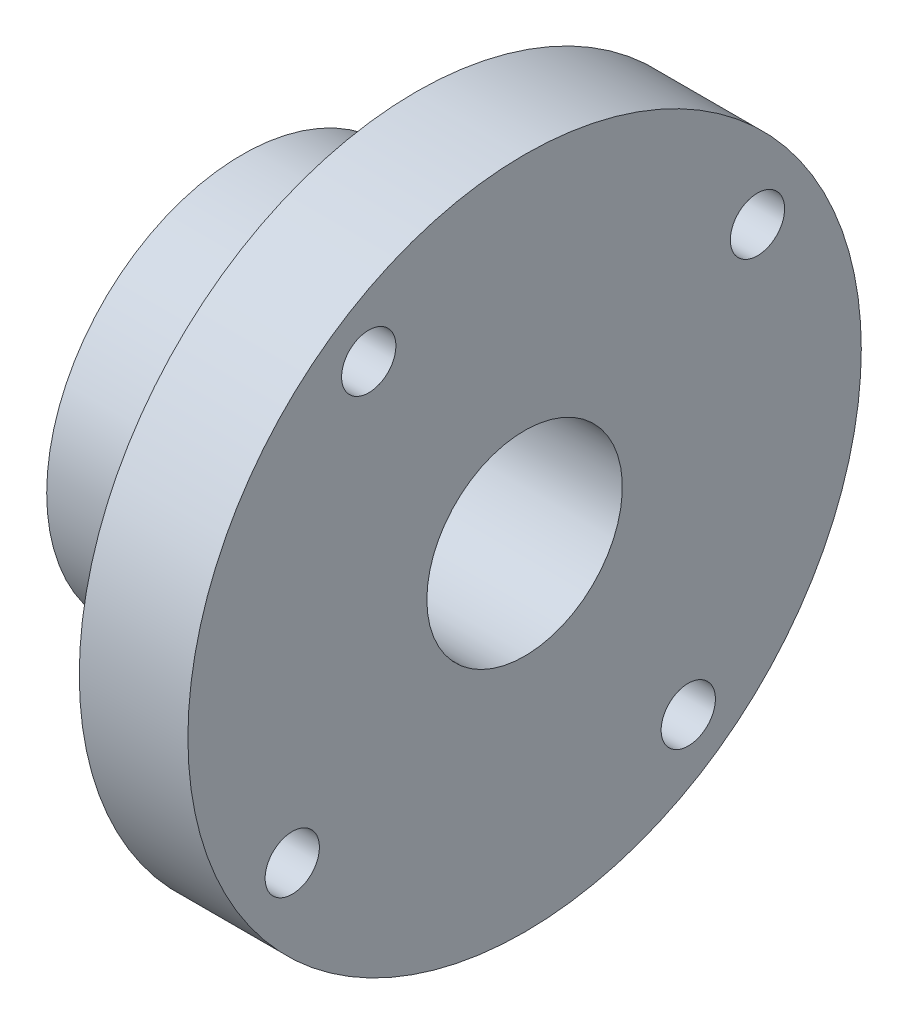
ISO-10303-21;
HEADER;
FILE_DESCRIPTION(('STEP AP214'),'2;1');
FILE_NAME('part.step','',(''),(''),'','','');
FILE_SCHEMA(('AUTOMOTIVE_DESIGN { 1 0 10303 214 1 1 1 1 }'));
ENDSEC;
DATA;
#1=APPLICATION_CONTEXT('core data for automotive mechanical design processes');
#2=APPLICATION_PROTOCOL_DEFINITION('international standard','automotive_design',2000,#1);
#3=PRODUCT_CONTEXT('',#1,'mechanical');
#4=PRODUCT('Part','Part','',(#3));
#5=PRODUCT_RELATED_PRODUCT_CATEGORY('part','',(#4));
#6=PRODUCT_DEFINITION_FORMATION('','',#4);
#7=PRODUCT_DEFINITION_CONTEXT('part definition',#1,'design');
#8=PRODUCT_DEFINITION('design','',#6,#7);
#9=PRODUCT_DEFINITION_SHAPE('','',#8);
#10=(LENGTH_UNIT() NAMED_UNIT(*) SI_UNIT(.MILLI.,.METRE.));
#11=(NAMED_UNIT(*) PLANE_ANGLE_UNIT() SI_UNIT($,.RADIAN.));
#12=(NAMED_UNIT(*) SI_UNIT($,.STERADIAN.) SOLID_ANGLE_UNIT());
#13=UNCERTAINTY_MEASURE_WITH_UNIT(LENGTH_MEASURE(1.E-05),#10,'distance_accuracy_value','');
#14=(GEOMETRIC_REPRESENTATION_CONTEXT(3) GLOBAL_UNCERTAINTY_ASSIGNED_CONTEXT((#13)) GLOBAL_UNIT_ASSIGNED_CONTEXT((#10,
#11,#12)) REPRESENTATION_CONTEXT('',''));
#15=CARTESIAN_POINT('',(0.,0.,0.));
#16=DIRECTION('',(0.,0.,1.));
#17=DIRECTION('',(1.,0.,0.));
#18=AXIS2_PLACEMENT_3D('',#15,#16,#17);
#19=CARTESIAN_POINT('',(0.,0.,0.));
#20=DIRECTION('',(1.,0.,0.));
#21=DIRECTION('',(0.,0.,-1.));
#22=AXIS2_PLACEMENT_3D('',#19,#20,#21);
#23=PLANE('',#22);
#24=CARTESIAN_POINT('',(0.,0.,0.));
#25=DIRECTION('',(-1.,0.,0.));
#26=DIRECTION('',(0.,0.,1.));
#27=AXIS2_PLACEMENT_3D('',#24,#25,#26);
#28=CIRCLE('',#27,4.49999999999999);
#29=CARTESIAN_POINT('',(0.,0.,4.49999999999999));
#30=VERTEX_POINT('',#29);
#31=EDGE_CURVE('E60',#30,#30,#28,.T.);
#32=ORIENTED_EDGE('',*,*,#31,.F.);
#33=EDGE_LOOP('',(#32));
#34=FACE_BOUND('',#33,.T.);
#35=CARTESIAN_POINT('',(0.,0.,0.));
#36=DIRECTION('',(-1.,0.,0.));
#37=DIRECTION('',(0.,0.,1.));
#38=AXIS2_PLACEMENT_3D('',#35,#36,#37);
#39=CIRCLE('',#38,7.);
#40=CARTESIAN_POINT('',(0.,0.,7.));
#41=VERTEX_POINT('',#40);
#42=EDGE_CURVE('E10',#41,#41,#39,.T.);
#43=ORIENTED_EDGE('',*,*,#42,.T.);
#44=EDGE_LOOP('',(#43));
#45=FACE_BOUND('',#44,.T.);
#46=ADVANCED_FACE('F32',(#34,#45),#23,.F.);
#47=CARTESIAN_POINT('',(0.,0.,0.));
#48=DIRECTION('',(-1.,0.,0.));
#49=DIRECTION('',(0.,0.,1.));
#50=AXIS2_PLACEMENT_3D('',#47,#48,#49);
#51=CYLINDRICAL_SURFACE('',#50,7.);
#52=ORIENTED_EDGE('',*,*,#42,.F.);
#53=EDGE_LOOP('',(#52));
#54=FACE_BOUND('',#53,.T.);
#55=CARTESIAN_POINT('',(0.8,0.,0.));
#56=DIRECTION('',(-1.,0.,0.));
#57=DIRECTION('',(0.,0.,1.));
#58=AXIS2_PLACEMENT_3D('',#55,#56,#57);
#59=CIRCLE('',#58,7.);
#60=CARTESIAN_POINT('',(0.8,0.,7.));
#61=VERTEX_POINT('',#60);
#62=EDGE_CURVE('E38',#61,#61,#59,.T.);
#63=ORIENTED_EDGE('',*,*,#62,.T.);
#64=EDGE_LOOP('',(#63));
#65=FACE_BOUND('',#64,.T.);
#66=ADVANCED_FACE('F111',(#54,#65),#51,.T.);
#67=CARTESIAN_POINT('',(0.8,7.,0.));
#68=DIRECTION('',(1.,0.,0.));
#69=DIRECTION('',(0.,0.,-1.));
#70=AXIS2_PLACEMENT_3D('',#67,#68,#69);
#71=PLANE('',#70);
#72=ORIENTED_EDGE('',*,*,#62,.F.);
#73=EDGE_LOOP('',(#72));
#74=FACE_BOUND('',#73,.T.);
#75=CARTESIAN_POINT('',(0.8,0.,0.));
#76=DIRECTION('',(-1.,0.,0.));
#77=DIRECTION('',(0.,0.,1.));
#78=AXIS2_PLACEMENT_3D('',#75,#76,#77);
#79=CIRCLE('',#78,9.);
#80=CARTESIAN_POINT('',(0.8,0.,9.));
#81=VERTEX_POINT('',#80);
#82=EDGE_CURVE('E42',#81,#81,#79,.T.);
#83=ORIENTED_EDGE('',*,*,#82,.T.);
#84=EDGE_LOOP('',(#83));
#85=FACE_BOUND('',#84,.T.);
#86=ADVANCED_FACE('F106',(#74,#85),#71,.F.);
#87=CARTESIAN_POINT('',(0.,0.,0.));
#88=DIRECTION('',(-1.,0.,0.));
#89=DIRECTION('',(0.,0.,1.));
#90=AXIS2_PLACEMENT_3D('',#87,#88,#89);
#91=CYLINDRICAL_SURFACE('',#90,9.);
#92=CARTESIAN_POINT('',(4.56642652347707,1.69370478848819,-8.83919476476518));
#93=CARTESIAN_POINT('',(4.47458480667076,1.69370123663776,-8.83919653942722));
#94=CARTESIAN_POINT('',(4.38269645061478,1.68601792819903,-8.8406783500862));
#95=CARTESIAN_POINT('',(4.20150808720222,1.65550627420318,-8.84644170912226));
#96=CARTESIAN_POINT('',(4.11221038507558,1.63266484740401,-8.85072567567445));
#97=CARTESIAN_POINT('',(3.93885129779513,1.57255797325403,-8.86160185859869));
#98=CARTESIAN_POINT('',(3.85478522090824,1.53530567247893,-8.86819197062734));
#99=CARTESIAN_POINT('',(3.69410755731031,1.44746626537444,-8.88295085369341));
#100=CARTESIAN_POINT('',(3.61749533628368,1.39688029508811,-8.89111949022301));
#101=CARTESIAN_POINT('',(3.47298177684864,1.28316432104925,-8.90824457234338));
#102=CARTESIAN_POINT('',(3.40518204505076,1.21990629891186,-8.91720849026524));
#103=CARTESIAN_POINT('',(3.28110275233958,1.08291474038756,-8.93487865001724));
#104=CARTESIAN_POINT('',(3.22482393190853,1.00918053118149,-8.94358487525397));
#105=CARTESIAN_POINT('',(3.12499628405075,0.852660978970428,-8.95986580821175));
#106=CARTESIAN_POINT('',(3.08154300511002,0.769813715425241,-8.9674318271497));
#107=CARTESIAN_POINT('',(3.00921520394921,0.597832323313218,-8.98053586604881));
#108=CARTESIAN_POINT('',(2.98033953584339,0.508698689519896,-8.98607404540065));
#109=CARTESIAN_POINT('',(2.93830012723746,0.327724674974344,-8.99448203776021));
#110=CARTESIAN_POINT('',(2.92496520770285,0.235925425283924,-8.99738084375545));
#111=CARTESIAN_POINT('',(2.91385268177002,0.0513483211881513,-9.00032661567337));
#112=CARTESIAN_POINT('',(2.91607380642194,-0.0414294527797896,-9.00037381420659));
#113=CARTESIAN_POINT('',(2.93587857420601,-0.224156525851392,-8.99766677871003));
#114=CARTESIAN_POINT('',(2.95327792049152,-0.314126392029767,-8.9949460872789));
#115=CARTESIAN_POINT('',(3.00265401487766,-0.489859602190279,-8.98708957397054));
#116=CARTESIAN_POINT('',(3.03463127678611,-0.575622797787647,-8.98195366696731));
#117=CARTESIAN_POINT('',(3.11243265609037,-0.741043520151741,-8.96982591300897));
#118=CARTESIAN_POINT('',(3.15833091796396,-0.820665417113695,-8.96282415321348));
#119=CARTESIAN_POINT('',(3.2626168500593,-0.971151758409421,-8.94777023149572));
#120=CARTESIAN_POINT('',(3.32100573657394,-1.04201534882923,-8.93971796730886));
#121=CARTESIAN_POINT('',(3.44963245299541,-1.17406213473022,-8.92334452983281));
#122=CARTESIAN_POINT('',(3.52003149048864,-1.23508812705074,-8.91502114472926));
#123=CARTESIAN_POINT('',(3.67014185014585,-1.34448631140504,-8.89918093456902));
#124=CARTESIAN_POINT('',(3.74985329698041,-1.39285833400478,-8.89166412031295));
#125=CARTESIAN_POINT('',(3.91652871866822,-1.47561411523553,-8.87830678117956));
#126=CARTESIAN_POINT('',(4.00350386215949,-1.50997583617216,-8.87246890142195));
#127=CARTESIAN_POINT('',(4.18212258267022,-1.56354346248132,-8.86318668664431));
#128=CARTESIAN_POINT('',(4.27376565458228,-1.58275100396472,-8.85974209323952));
#129=CARTESIAN_POINT('',(4.45770347155008,-1.60523547639814,-8.85569586860607));
#130=CARTESIAN_POINT('',(4.5499697691321,-1.60873810674483,-8.85505396276904));
#131=CARTESIAN_POINT('',(4.73376855974932,-1.60031732420666,-8.85657959446424));
#132=CARTESIAN_POINT('',(4.82530108718983,-1.58839463889761,-8.85874699948791));
#133=CARTESIAN_POINT('',(5.00429798209743,-1.54965609459651,-8.86560454609511));
#134=CARTESIAN_POINT('',(5.09178863503208,-1.52295782942895,-8.87027475950189));
#135=CARTESIAN_POINT('',(5.26105855430728,-1.45555243985945,-8.88158363857301));
#136=CARTESIAN_POINT('',(5.34283741542952,-1.41484432275213,-8.88822244372256));
#137=CARTESIAN_POINT('',(5.49935790132167,-1.32005542223993,-8.90279561241024));
#138=CARTESIAN_POINT('',(5.57401167198007,-1.26583169021407,-8.91074349518184));
#139=CARTESIAN_POINT('',(5.71324886942261,-1.1457477737579,-8.92697733712146));
#140=CARTESIAN_POINT('',(5.77783143140438,-1.07988659106856,-8.93526332524519));
#141=CARTESIAN_POINT('',(5.89593142071714,-0.937394807779964,-8.9513399388311));
#142=CARTESIAN_POINT('',(5.94929745454772,-0.86063773645111,-8.95912291174869));
#143=CARTESIAN_POINT('',(6.04238274083136,-0.699123335805003,-8.97317045526716));
#144=CARTESIAN_POINT('',(6.08210250221029,-0.614366304989595,-8.97943508249085));
#145=CARTESIAN_POINT('',(6.14653922794076,-0.439685693904368,-8.98967659981383));
#146=CARTESIAN_POINT('',(6.17133155382942,-0.349790618153867,-8.9936649762068));
#147=CARTESIAN_POINT('',(6.2054506424942,-0.167036983304314,-8.99891375037636));
#148=CARTESIAN_POINT('',(6.21477895791266,-0.074178722674019,-9.00017442202819));
#149=CARTESIAN_POINT('',(6.2176531250728,0.110410869957342,-8.99978916169948));
#150=CARTESIAN_POINT('',(6.21142797883256,0.202138803452779,-8.99818550222078));
#151=CARTESIAN_POINT('',(6.18387218079221,0.383204997902581,-8.99229455347867));
#152=CARTESIAN_POINT('',(6.16254166031921,0.472543279625726,-8.98800728754676));
#153=CARTESIAN_POINT('',(6.10547535689572,0.646181716882685,-8.97719391866451));
#154=CARTESIAN_POINT('',(6.06976293481065,0.730489789340933,-8.97067144895741));
#155=CARTESIAN_POINT('',(5.98497358388261,0.891943341697937,-8.95606028716957));
#156=CARTESIAN_POINT('',(5.93589581279914,0.969088369794138,-8.94797149639369));
#157=CARTESIAN_POINT('',(5.82497567145895,1.11517225577969,-8.93095069894388));
#158=CARTESIAN_POINT('',(5.76296736593983,1.183983964223,-8.92200864361386));
#159=CARTESIAN_POINT('',(5.62829162281997,1.31030521286801,-8.9043348262692));
#160=CARTESIAN_POINT('',(5.55562168541408,1.36781209503699,-8.89560311413368));
#161=CARTESIAN_POINT('',(5.40092290299377,1.47036737016453,-8.87923127815512));
#162=CARTESIAN_POINT('',(5.31881746796914,1.51530190979664,-8.87160141477639));
#163=CARTESIAN_POINT('',(5.14810896015069,1.59067806915375,-8.85839825842966));
#164=CARTESIAN_POINT('',(5.0595121900287,1.62113353744503,-8.85282300147758));
#165=CARTESIAN_POINT('',(4.90326738191738,1.66041027229655,-8.84552488070256));
#166=CARTESIAN_POINT('',(4.83654108539598,1.67287465681076,-8.84316473560124));
#167=CARTESIAN_POINT('',(4.70202715831775,1.68952312214118,-8.83999904199076));
#168=CARTESIAN_POINT('',(4.63423955447813,1.69370741106268,-8.83919345441062));
#169=CARTESIAN_POINT('',(4.56642652347707,1.69370478848819,-8.83919476476518));
#170=B_SPLINE_CURVE_WITH_KNOTS('',3,(#92,#93,#94,#95,#96,#97,#98,#99,#100,#101,#102,#103,#104,
#105,#106,#107,#108,#109,#110,#111,#112,#113,#114,#115,#116,#117,#118,#119,#120,#121,#122,#123,
#124,#125,#126,#127,#128,#129,#130,#131,#132,#133,#134,#135,#136,#137,#138,#139,#140,#141,#142,
#143,#144,#145,#146,#147,#148,#149,#150,#151,#152,#153,#154,#155,#156,#157,#158,#159,#160,#161,
#162,#163,#164,#165,#166,#167,#168,#169),.UNSPECIFIED.,.T.,.F.,(4,2,2,2,2,2,2,2,2,2,2,2,2,2,2,2,
2,2,2,2,2,2,2,2,2,2,2,2,2,2,2,2,2,2,2,2,2,2,4),(0.,0.275277027247348,0.550791924145746,
0.826056068166017,1.10129676696005,1.37947266842812,1.65766644345526,1.93788324035368,
2.21807800713692,2.49515639448048,2.77221218003151,3.04595000369876,3.31969747617384,
3.59492934730965,3.87018803176224,4.14948338686982,4.42878248149328,4.70851922412505,
4.98822576103178,5.26389940371881,5.5395600440036,5.81305770418114,6.08657474775528,
6.36311747087756,6.6396839273255,6.91977256631177,7.19985075850149,7.47850284688865,
7.75712695590776,8.03167297656667,8.30621661033368,8.58031608354239,8.85443283360041,
9.13231150460444,9.41025543353239,9.69064042578673,9.97075670045879,10.1740176957908,
10.3772735824591),.UNSPECIFIED.);
#171=CARTESIAN_POINT('',(4.56642652347707,1.69370478848819,-8.83919476476518));
#172=VERTEX_POINT('',#171);
#173=EDGE_CURVE('E63',#172,#172,#170,.T.);
#174=ORIENTED_EDGE('',*,*,#173,.T.);
#175=EDGE_LOOP('',(#174));
#176=FACE_BOUND('',#175,.T.);
#177=ORIENTED_EDGE('',*,*,#82,.F.);
#178=EDGE_LOOP('',(#177));
#179=FACE_BOUND('',#178,.T.);
#180=CARTESIAN_POINT('',(8.8,0.,0.));
#181=DIRECTION('',(-1.,0.,0.));
#182=DIRECTION('',(0.,0.,1.));
#183=AXIS2_PLACEMENT_3D('',#180,#181,#182);
#184=CIRCLE('',#183,9.);
#185=CARTESIAN_POINT('',(8.8,0.,9.));
#186=VERTEX_POINT('',#185);
#187=EDGE_CURVE('E46',#186,#186,#184,.T.);
#188=ORIENTED_EDGE('',*,*,#187,.T.);
#189=EDGE_LOOP('',(#188));
#190=FACE_BOUND('',#189,.T.);
#191=ADVANCED_FACE('F75',(#176,#179,#190),#91,.T.);
#192=CARTESIAN_POINT('',(8.8,9.,0.));
#193=DIRECTION('',(1.,0.,0.));
#194=DIRECTION('',(0.,0.,-1.));
#195=AXIS2_PLACEMENT_3D('',#192,#193,#194);
#196=PLANE('',#195);
#197=CARTESIAN_POINT('',(8.8,7.35555724349682,-10.7189448005688));
#198=DIRECTION('',(-1.,0.,0.));
#199=DIRECTION('',(0.,0.,1.));
#200=AXIS2_PLACEMENT_3D('',#197,#198,#199);
#201=CIRCLE('',#200,1.25);
#202=CARTESIAN_POINT('',(8.8,7.35555724349682,-9.46894480056885));
#203=VERTEX_POINT('',#202);
#204=EDGE_CURVE('E212',#203,#203,#201,.T.);
#205=ORIENTED_EDGE('',*,*,#204,.F.);
#206=EDGE_LOOP('',(#205));
#207=FACE_BOUND('',#206,.T.);
#208=CARTESIAN_POINT('',(8.8,10.8407655026049,7.174803364381));
#209=DIRECTION('',(-1.,0.,0.));
#210=DIRECTION('',(0.,0.,1.));
#211=AXIS2_PLACEMENT_3D('',#208,#209,#210);
#212=CIRCLE('',#211,1.25);
#213=CARTESIAN_POINT('',(8.8,10.8407655026049,8.424803364381));
#214=VERTEX_POINT('',#213);
#215=EDGE_CURVE('E214',#214,#214,#212,.T.);
#216=ORIENTED_EDGE('',*,*,#215,.F.);
#217=EDGE_LOOP('',(#216));
#218=FACE_BOUND('',#217,.T.);
#219=CARTESIAN_POINT('',(8.8,-7.38923449739515,10.6957568008302));
#220=DIRECTION('',(-1.,0.,0.));
#221=DIRECTION('',(0.,0.,1.));
#222=AXIS2_PLACEMENT_3D('',#219,#220,#221);
#223=CIRCLE('',#222,1.25);
#224=CARTESIAN_POINT('',(8.8,-7.38923449739515,11.9457568008302));
#225=VERTEX_POINT('',#224);
#226=EDGE_CURVE('E222',#225,#225,#223,.T.);
#227=ORIENTED_EDGE('',*,*,#226,.F.);
#228=EDGE_LOOP('',(#227));
#229=FACE_BOUND('',#228,.T.);
#230=CARTESIAN_POINT('',(8.8,-10.5941106005065,-7.53424319916978));
#231=DIRECTION('',(-1.,0.,0.));
#232=DIRECTION('',(0.,0.,1.));
#233=AXIS2_PLACEMENT_3D('',#230,#231,#232);
#234=CIRCLE('',#233,1.25);
#235=CARTESIAN_POINT('',(8.8,-10.5941106005065,-6.28424319916978));
#236=VERTEX_POINT('',#235);
#237=EDGE_CURVE('E228',#236,#236,#234,.T.);
#238=ORIENTED_EDGE('',*,*,#237,.F.);
#239=EDGE_LOOP('',(#238));
#240=FACE_BOUND('',#239,.T.);
#241=ORIENTED_EDGE('',*,*,#187,.F.);
#242=EDGE_LOOP('',(#241));
#243=FACE_BOUND('',#242,.T.);
#244=CARTESIAN_POINT('',(8.8,0.,0.));
#245=DIRECTION('',(-1.,0.,0.));
#246=DIRECTION('',(0.,0.,1.));
#247=AXIS2_PLACEMENT_3D('',#244,#245,#246);
#248=CIRCLE('',#247,15.5);
#249=CARTESIAN_POINT('',(8.8,0.,15.5));
#250=VERTEX_POINT('',#249);
#251=EDGE_CURVE('E51',#250,#250,#248,.T.);
#252=ORIENTED_EDGE('',*,*,#251,.T.);
#253=EDGE_LOOP('',(#252));
#254=FACE_BOUND('',#253,.T.);
#255=ADVANCED_FACE('F99',(#207,#218,#229,#240,#243,#254),#196,.F.);
#256=CARTESIAN_POINT('',(0.,0.,0.));
#257=DIRECTION('',(-1.,0.,0.));
#258=DIRECTION('',(0.,0.,1.));
#259=AXIS2_PLACEMENT_3D('',#256,#257,#258);
#260=CYLINDRICAL_SURFACE('',#259,15.5);
#261=ORIENTED_EDGE('',*,*,#251,.F.);
#262=EDGE_LOOP('',(#261));
#263=FACE_BOUND('',#262,.T.);
#264=CARTESIAN_POINT('',(13.8,0.,0.));
#265=DIRECTION('',(-1.,0.,0.));
#266=DIRECTION('',(0.,0.,1.));
#267=AXIS2_PLACEMENT_3D('',#264,#265,#266);
#268=CIRCLE('',#267,15.5);
#269=CARTESIAN_POINT('',(13.8,0.,15.5));
#270=VERTEX_POINT('',#269);
#271=EDGE_CURVE('E54',#270,#270,#268,.T.);
#272=ORIENTED_EDGE('',*,*,#271,.T.);
#273=EDGE_LOOP('',(#272));
#274=FACE_BOUND('',#273,.T.);
#275=ADVANCED_FACE('F96',(#263,#274),#260,.T.);
#276=CARTESIAN_POINT('',(13.8,15.5,0.));
#277=DIRECTION('',(-1.,0.,0.));
#278=DIRECTION('',(0.,0.,1.));
#279=AXIS2_PLACEMENT_3D('',#276,#277,#278);
#280=PLANE('',#279);
#281=CARTESIAN_POINT('',(13.8,7.35555724349682,-10.7189448005688));
#282=DIRECTION('',(-1.,0.,0.));
#283=DIRECTION('',(0.,0.,1.));
#284=AXIS2_PLACEMENT_3D('',#281,#282,#283);
#285=CIRCLE('',#284,1.25);
#286=CARTESIAN_POINT('',(13.8,7.35555724349682,-9.46894480056885));
#287=VERTEX_POINT('',#286);
#288=EDGE_CURVE('E210',#287,#287,#285,.T.);
#289=ORIENTED_EDGE('',*,*,#288,.T.);
#290=EDGE_LOOP('',(#289));
#291=FACE_BOUND('',#290,.T.);
#292=CARTESIAN_POINT('',(13.8,10.8407655026049,7.174803364381));
#293=DIRECTION('',(-1.,0.,0.));
#294=DIRECTION('',(0.,0.,1.));
#295=AXIS2_PLACEMENT_3D('',#292,#293,#294);
#296=CIRCLE('',#295,1.25);
#297=CARTESIAN_POINT('',(13.8,10.8407655026049,8.424803364381));
#298=VERTEX_POINT('',#297);
#299=EDGE_CURVE('E219',#298,#298,#296,.T.);
#300=ORIENTED_EDGE('',*,*,#299,.T.);
#301=EDGE_LOOP('',(#300));
#302=FACE_BOUND('',#301,.T.);
#303=CARTESIAN_POINT('',(13.8,-7.38923449739515,10.6957568008302));
#304=DIRECTION('',(-1.,0.,0.));
#305=DIRECTION('',(0.,0.,1.));
#306=AXIS2_PLACEMENT_3D('',#303,#304,#305);
#307=CIRCLE('',#306,1.25);
#308=CARTESIAN_POINT('',(13.8,-7.38923449739515,11.9457568008302));
#309=VERTEX_POINT('',#308);
#310=EDGE_CURVE('E225',#309,#309,#307,.T.);
#311=ORIENTED_EDGE('',*,*,#310,.T.);
#312=EDGE_LOOP('',(#311));
#313=FACE_BOUND('',#312,.T.);
#314=CARTESIAN_POINT('',(13.8,-10.5941106005065,-7.53424319916978));
#315=DIRECTION('',(-1.,0.,0.));
#316=DIRECTION('',(0.,0.,1.));
#317=AXIS2_PLACEMENT_3D('',#314,#315,#316);
#318=CIRCLE('',#317,1.25);
#319=CARTESIAN_POINT('',(13.8,-10.5941106005065,-6.28424319916978));
#320=VERTEX_POINT('',#319);
#321=EDGE_CURVE('E230',#320,#320,#318,.T.);
#322=ORIENTED_EDGE('',*,*,#321,.T.);
#323=EDGE_LOOP('',(#322));
#324=FACE_BOUND('',#323,.T.);
#325=CARTESIAN_POINT('',(13.8,0.,0.));
#326=DIRECTION('',(-1.,0.,0.));
#327=DIRECTION('',(0.,0.,1.));
#328=AXIS2_PLACEMENT_3D('',#325,#326,#327);
#329=CIRCLE('',#328,4.49999999999999);
#330=CARTESIAN_POINT('',(13.8,0.,4.49999999999999));
#331=VERTEX_POINT('',#330);
#332=EDGE_CURVE('E57',#331,#331,#329,.T.);
#333=ORIENTED_EDGE('',*,*,#332,.T.);
#334=EDGE_LOOP('',(#333));
#335=FACE_BOUND('',#334,.T.);
#336=ORIENTED_EDGE('',*,*,#271,.F.);
#337=EDGE_LOOP('',(#336));
#338=FACE_BOUND('',#337,.T.);
#339=ADVANCED_FACE('F92',(#291,#302,#313,#324,#335,#338),#280,.F.);
#340=CARTESIAN_POINT('',(0.,0.,0.));
#341=DIRECTION('',(-1.,0.,0.));
#342=DIRECTION('',(0.,0.,1.));
#343=AXIS2_PLACEMENT_3D('',#340,#341,#342);
#344=CYLINDRICAL_SURFACE('',#343,4.49999999999999);
#345=CARTESIAN_POINT('',(4.56642652347707,1.67067033734109,-4.1783801435399));
#346=CARTESIAN_POINT('',(4.65569553076826,1.67067297942623,-4.1783777208114));
#347=CARTESIAN_POINT('',(4.7449465978439,1.66341599790145,-4.18130225625927));
#348=CARTESIAN_POINT('',(4.92076741570407,1.63470343508581,-4.19261010330789));
#349=CARTESIAN_POINT('',(5.00733715016246,1.61324776735955,-4.20099344813949));
#350=CARTESIAN_POINT('',(5.17521046760388,1.55701944518417,-4.22215357961763));
#351=CARTESIAN_POINT('',(5.25652567455624,1.52227745001653,-4.23492024451524));
#352=CARTESIAN_POINT('',(5.41219369321437,1.44056542909248,-4.26340677156764));
#353=CARTESIAN_POINT('',(5.48654450750904,1.39359190980622,-4.27912747708866));
#354=CARTESIAN_POINT('',(5.62970316608866,1.28635526556398,-4.31260623345646));
#355=CARTESIAN_POINT('',(5.69813329330667,1.22560607606012,-4.3304229308484));
#356=CARTESIAN_POINT('',(5.82408438053488,1.09356606330635,-4.36563598030136));
#357=CARTESIAN_POINT('',(5.88160314252468,1.02227312122566,-4.38303224705491));
#358=CARTESIAN_POINT('',(5.98589591609936,0.868320435827614,-4.41615303485791));
#359=CARTESIAN_POINT('',(6.03226244325282,0.78536772763325,-4.43180532792168));
#360=CARTESIAN_POINT('',(6.11021441545308,0.612163361441621,-4.45902741525707));
#361=CARTESIAN_POINT('',(6.14180474478186,0.521914126901595,-4.47059855824405));
#362=CARTESIAN_POINT('',(6.18799206303119,0.340640769644416,-4.48797353574095));
#363=CARTESIAN_POINT('',(6.20323865867453,0.249803541112603,-4.49399638027201));
#364=CARTESIAN_POINT('',(6.21838382281111,0.0666729761982237,-4.50043759970651));
#365=CARTESIAN_POINT('',(6.21828716367339,-0.0256198984890482,-4.50085771723921));
#366=CARTESIAN_POINT('',(6.20313393237423,-0.20439729723383,-4.49620345805035));
#367=CARTESIAN_POINT('',(6.18878565348926,-0.290949977883381,-4.49138820339338));
#368=CARTESIAN_POINT('',(6.1467237100051,-0.460343892422022,-4.47719906115222));
#369=CARTESIAN_POINT('',(6.1190091043986,-0.543184864553022,-4.46782485261117));
#370=CARTESIAN_POINT('',(6.05065519993788,-0.704206018040558,-4.44531250203911));
#371=CARTESIAN_POINT('',(6.00983649963161,-0.782302467525683,-4.43212238189412));
#372=CARTESIAN_POINT('',(5.91658936669257,-0.930740249846231,-4.40334504514832));
#373=CARTESIAN_POINT('',(5.86415728266175,-1.00107913316046,-4.38775707510445));
#374=CARTESIAN_POINT('',(5.74572563280734,-1.13618701048835,-4.35478879061767));
#375=CARTESIAN_POINT('',(5.6791294094688,-1.20042122172648,-4.33735698131527));
#376=CARTESIAN_POINT('',(5.5360079532746,-1.31700224135918,-4.30339409206012));
#377=CARTESIAN_POINT('',(5.45948045385326,-1.36934632860651,-4.28686321895024));
#378=CARTESIAN_POINT('',(5.29664581665288,-1.46161653996861,-4.25630074777577));
#379=CARTESIAN_POINT('',(5.21017100802096,-1.5012675237005,-4.24232702104396));
#380=CARTESIAN_POINT('',(5.03112782327083,-1.56522341876162,-4.21915236021271));
#381=CARTESIAN_POINT('',(4.93856268778762,-1.58953641959436,-4.20994891064864));
#382=CARTESIAN_POINT('',(4.75523407369665,-1.62092920459183,-4.19795874203403));
#383=CARTESIAN_POINT('',(4.66463645042071,-1.6288564779259,-4.19485688886781));
#384=CARTESIAN_POINT('',(4.48337338124575,-1.62968737229919,-4.19453474432043));
#385=CARTESIAN_POINT('',(4.3927079562286,-1.62259451533533,-4.19731307412383));
#386=CARTESIAN_POINT('',(4.21811514719547,-1.59435498448015,-4.20811596695527));
#387=CARTESIAN_POINT('',(4.13406757760757,-1.5738490346773,-4.21590109063567));
#388=CARTESIAN_POINT('',(3.97063315783644,-1.52016687424568,-4.23555236791804));
#389=CARTESIAN_POINT('',(3.89124724053276,-1.4869881374688,-4.24741933513318));
#390=CARTESIAN_POINT('',(3.73617994321368,-1.40754569350472,-4.27441589171461));
#391=CARTESIAN_POINT('',(3.66073842679029,-1.36084983925647,-4.28964847559612));
#392=CARTESIAN_POINT('',(3.51844756949023,-1.25617126058262,-4.32146066085659));
#393=CARTESIAN_POINT('',(3.45160126556724,-1.19818456485051,-4.33804073498684));
#394=CARTESIAN_POINT('',(3.32423233201337,-1.06844883520788,-4.37186094849437));
#395=CARTESIAN_POINT('',(3.26433152913005,-0.996081979883894,-4.38908084028082));
#396=CARTESIAN_POINT('',(3.15744209712702,-0.84190066786704,-4.42124377274089));
#397=CARTESIAN_POINT('',(3.11045338086646,-0.760086274938841,-4.43618682878009));
#398=CARTESIAN_POINT('',(3.031064720245,-0.58948055772642,-4.46205286106061));
#399=CARTESIAN_POINT('',(2.99860290310317,-0.500720752346599,-4.47299285005939));
#400=CARTESIAN_POINT('',(2.94923332913629,-0.318515729326307,-4.48964357031487));
#401=CARTESIAN_POINT('',(2.93231862341827,-0.225072624633132,-4.49535663777636));
#402=CARTESIAN_POINT('',(2.91524782394265,-0.0417905131842865,-4.50068755584046));
#403=CARTESIAN_POINT('',(2.91420656879966,0.0479574130199928,-4.50062872097718));
#404=CARTESIAN_POINT('',(2.9266547981874,0.226266544631607,-4.49519259904477));
#405=CARTESIAN_POINT('',(2.94014265827862,0.314827881585789,-4.48981590654853));
#406=CARTESIAN_POINT('',(2.98065018294106,0.486235816458396,-4.4744632241232));
#407=CARTESIAN_POINT('',(3.00735861487606,0.569166154341272,-4.4645934193836));
#408=CARTESIAN_POINT('',(3.07324424981478,0.729362562403388,-4.44123743321837));
#409=CARTESIAN_POINT('',(3.11242380578089,0.806627560299456,-4.42775056942761));
#410=CARTESIAN_POINT('',(3.20397851996079,0.956783315662643,-4.39780278021736));
#411=CARTESIAN_POINT('',(3.2568303246238,1.02936324822095,-4.38124231144678));
#412=CARTESIAN_POINT('',(3.37346601770602,1.16489522674892,-4.34717276525688));
#413=CARTESIAN_POINT('',(3.43725373439154,1.22784388650608,-4.32966335712121));
#414=CARTESIAN_POINT('',(3.5777395114935,1.34555813362169,-4.29458220327099));
#415=CARTESIAN_POINT('',(3.65492295782148,1.39975866097376,-4.27705094340428));
#416=CARTESIAN_POINT('',(3.81786410834462,1.49444147948042,-4.24489751617637));
#417=CARTESIAN_POINT('',(3.90362199079855,1.53492348535614,-4.23027540931408));
#418=CARTESIAN_POINT('',(4.08367211993449,1.60159111339426,-4.20549827276817));
#419=CARTESIAN_POINT('',(4.17812418295548,1.62739380976743,-4.19546412729177));
#420=CARTESIAN_POINT('',(4.3705349170741,1.66192701158335,-4.18190828400572));
#421=CARTESIAN_POINT('',(4.46849151650657,1.67066743876931,-4.17838280146049));
#422=CARTESIAN_POINT('',(4.56642652347707,1.67067033734109,-4.1783801435399));
#423=B_SPLINE_CURVE_WITH_KNOTS('',3,(#345,#346,#347,#348,#349,#350,#351,#352,#353,#354,#355,
#356,#357,#358,#359,#360,#361,#362,#363,#364,#365,#366,#367,#368,#369,#370,#371,#372,#373,#374,
#375,#376,#377,#378,#379,#380,#381,#382,#383,#384,#385,#386,#387,#388,#389,#390,#391,#392,#393,
#394,#395,#396,#397,#398,#399,#400,#401,#402,#403,#404,#405,#406,#407,#408,#409,#410,#411,#412,
#413,#414,#415,#416,#417,#418,#419,#420,#421,#422),.UNSPECIFIED.,.T.,.F.,(4,2,2,2,2,2,2,2,2,2,2,
2,2,2,2,2,2,2,2,2,2,2,2,2,2,2,2,2,2,2,2,2,2,2,2,2,2,2,4),(0.,0.267442750870635,
0.534887129831028,0.801718047109132,1.06862525955752,1.34705180470466,1.62553437756671,
1.91302002974545,2.2004105860785,2.4758986359751,2.75130099818134,3.01366812385006,
3.27605372321315,3.54219675072454,3.80842357612977,4.08960432418398,4.37084935794837,
4.6578323782497,4.94466391218283,5.21624592384208,5.48776426061462,5.74717629931305,
6.0066400752908,6.27554382527954,6.54454232768877,6.82971371694664,7.11488318159768,
7.3988262188592,7.68264228394246,7.95056992622029,8.21846761573975,8.48033876673377,
8.74225935501662,9.01495774015791,9.28775178276932,9.57415790679349,9.86056998631388,
10.1541461397804,10.4475515272211),.UNSPECIFIED.);
#424=CARTESIAN_POINT('',(4.56642652347707,1.67067033734109,-4.1783801435399));
#425=VERTEX_POINT('',#424);
#426=EDGE_CURVE('E70',#425,#425,#423,.T.);
#427=ORIENTED_EDGE('',*,*,#426,.T.);
#428=EDGE_LOOP('',(#427));
#429=FACE_BOUND('',#428,.T.);
#430=ORIENTED_EDGE('',*,*,#332,.F.);
#431=EDGE_LOOP('',(#430));
#432=FACE_BOUND('',#431,.T.);
#433=ORIENTED_EDGE('',*,*,#31,.T.);
#434=EDGE_LOOP('',(#433));
#435=FACE_BOUND('',#434,.T.);
#436=ADVANCED_FACE('F84',(#429,#432,#435),#344,.F.);
#437=CARTESIAN_POINT('',(4.56642652347707,0.044478818716932,-8.99989009014474));
#438=DIRECTION('',(0.,0.00494209096854811,-0.99998778779386));
#439=DIRECTION('',(0.,0.99998778779386,0.00494209096854811));
#440=AXIS2_PLACEMENT_3D('',#437,#438,#439);
#441=CYLINDRICAL_SURFACE('',#440,1.64999999999999);
#442=ORIENTED_EDGE('',*,*,#426,.F.);
#443=EDGE_LOOP('',(#442));
#444=FACE_BOUND('',#443,.T.);
#445=ORIENTED_EDGE('',*,*,#173,.F.);
#446=EDGE_LOOP('',(#445));
#447=FACE_BOUND('',#446,.T.);
#448=ADVANCED_FACE('F79',(#444,#447),#441,.F.);
#449=CARTESIAN_POINT('',(8.8,-10.5941106005065,-7.53424319916978));
#450=DIRECTION('',(-1.,0.,0.));
#451=DIRECTION('',(0.,0.,1.));
#452=AXIS2_PLACEMENT_3D('',#449,#450,#451);
#453=CYLINDRICAL_SURFACE('',#452,1.25);
#454=ORIENTED_EDGE('',*,*,#321,.F.);
#455=EDGE_LOOP('',(#454));
#456=FACE_BOUND('',#455,.T.);
#457=ORIENTED_EDGE('',*,*,#237,.T.);
#458=EDGE_LOOP('',(#457));
#459=FACE_BOUND('',#458,.T.);
#460=ADVANCED_FACE('F83',(#456,#459),#453,.F.);
#461=CARTESIAN_POINT('',(8.8,-7.38923449739515,10.6957568008302));
#462=DIRECTION('',(-1.,0.,0.));
#463=DIRECTION('',(0.,0.,1.));
#464=AXIS2_PLACEMENT_3D('',#461,#462,#463);
#465=CYLINDRICAL_SURFACE('',#464,1.25);
#466=ORIENTED_EDGE('',*,*,#310,.F.);
#467=EDGE_LOOP('',(#466));
#468=FACE_BOUND('',#467,.T.);
#469=ORIENTED_EDGE('',*,*,#226,.T.);
#470=EDGE_LOOP('',(#469));
#471=FACE_BOUND('',#470,.T.);
#472=ADVANCED_FACE('F175',(#468,#471),#465,.F.);
#473=CARTESIAN_POINT('',(8.8,10.8407655026049,7.174803364381));
#474=DIRECTION('',(-1.,0.,0.));
#475=DIRECTION('',(0.,0.,1.));
#476=AXIS2_PLACEMENT_3D('',#473,#474,#475);
#477=CYLINDRICAL_SURFACE('',#476,1.25);
#478=ORIENTED_EDGE('',*,*,#299,.F.);
#479=EDGE_LOOP('',(#478));
#480=FACE_BOUND('',#479,.T.);
#481=ORIENTED_EDGE('',*,*,#215,.T.);
#482=EDGE_LOOP('',(#481));
#483=FACE_BOUND('',#482,.T.);
#484=ADVANCED_FACE('F184',(#480,#483),#477,.F.);
#485=CARTESIAN_POINT('',(8.8,7.35555724349682,-10.7189448005688));
#486=DIRECTION('',(-1.,0.,0.));
#487=DIRECTION('',(0.,0.,1.));
#488=AXIS2_PLACEMENT_3D('',#485,#486,#487);
#489=CYLINDRICAL_SURFACE('',#488,1.25);
#490=ORIENTED_EDGE('',*,*,#288,.F.);
#491=EDGE_LOOP('',(#490));
#492=FACE_BOUND('',#491,.T.);
#493=ORIENTED_EDGE('',*,*,#204,.T.);
#494=EDGE_LOOP('',(#493));
#495=FACE_BOUND('',#494,.T.);
#496=ADVANCED_FACE('F193',(#492,#495),#489,.F.);
#497=CLOSED_SHELL('',(#46,#66,#86,#191,#255,#275,#339,#436,#448,#460,#472,#484,#496));
#498=MANIFOLD_SOLID_BREP('B2',#497);
#499=ADVANCED_BREP_SHAPE_REPRESENTATION('',(#18,#498),#14);
#500=SHAPE_DEFINITION_REPRESENTATION(#9,#499);
ENDSEC;
END-ISO-10303-21;
